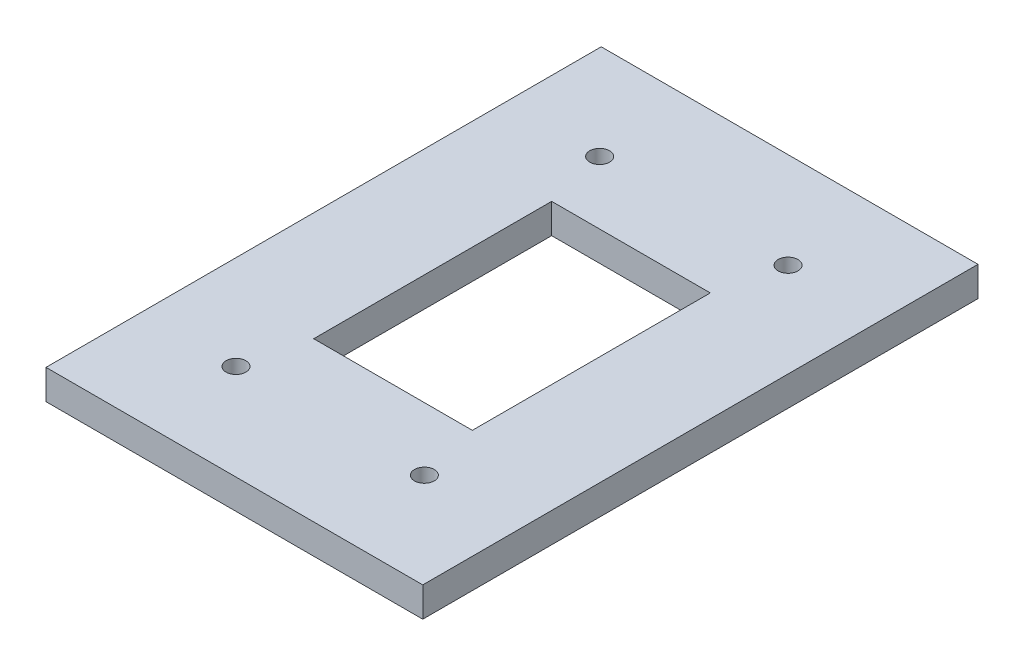
ISO-10303-21;
HEADER;
FILE_DESCRIPTION(('STEP AP214'),'2;1');
FILE_NAME('part.step','',(''),(''),'','','');
FILE_SCHEMA(('AUTOMOTIVE_DESIGN { 1 0 10303 214 1 1 1 1 }'));
ENDSEC;
DATA;
#1=APPLICATION_CONTEXT('core data for automotive mechanical design processes');
#2=APPLICATION_PROTOCOL_DEFINITION('international standard','automotive_design',2000,#1);
#3=PRODUCT_CONTEXT('',#1,'mechanical');
#4=PRODUCT('Part','Part','',(#3));
#5=PRODUCT_RELATED_PRODUCT_CATEGORY('part','',(#4));
#6=PRODUCT_DEFINITION_FORMATION('','',#4);
#7=PRODUCT_DEFINITION_CONTEXT('part definition',#1,'design');
#8=PRODUCT_DEFINITION('design','',#6,#7);
#9=PRODUCT_DEFINITION_SHAPE('','',#8);
#10=(LENGTH_UNIT() NAMED_UNIT(*) SI_UNIT(.MILLI.,.METRE.));
#11=(NAMED_UNIT(*) PLANE_ANGLE_UNIT() SI_UNIT($,.RADIAN.));
#12=(NAMED_UNIT(*) SI_UNIT($,.STERADIAN.) SOLID_ANGLE_UNIT());
#13=UNCERTAINTY_MEASURE_WITH_UNIT(LENGTH_MEASURE(1.E-05),#10,'distance_accuracy_value','');
#14=(GEOMETRIC_REPRESENTATION_CONTEXT(3) GLOBAL_UNCERTAINTY_ASSIGNED_CONTEXT((#13)) GLOBAL_UNIT_ASSIGNED_CONTEXT((#10,
#11,#12)) REPRESENTATION_CONTEXT('',''));
#15=CARTESIAN_POINT('',(0.,0.,0.));
#16=DIRECTION('',(0.,0.,1.));
#17=DIRECTION('',(1.,0.,0.));
#18=AXIS2_PLACEMENT_3D('',#15,#16,#17);
#19=CARTESIAN_POINT('',(-120.65,9.525,-177.8));
#20=DIRECTION('',(1.,0.,0.));
#21=DIRECTION('',(0.,0.,-1.));
#22=AXIS2_PLACEMENT_3D('',#19,#20,#21);
#23=PLANE('',#22);
#24=DIRECTION('',(0.,0.,1.));
#25=VECTOR('',#24,1.);
#26=CARTESIAN_POINT('',(-120.65,-9.525,-177.8));
#27=LINE('',#26,#25);
#28=CARTESIAN_POINT('',(-120.65,-9.525,-177.8));
#29=VERTEX_POINT('',#28);
#30=CARTESIAN_POINT('',(-120.65,-9.525,177.8));
#31=VERTEX_POINT('',#30);
#32=EDGE_CURVE('E157',#29,#31,#27,.T.);
#33=ORIENTED_EDGE('',*,*,#32,.T.);
#34=DIRECTION('',(0.,-1.,0.));
#35=VECTOR('',#34,1.);
#36=CARTESIAN_POINT('',(-120.65,9.525,177.8));
#37=LINE('',#36,#35);
#38=CARTESIAN_POINT('',(-120.65,9.525,177.8));
#39=VERTEX_POINT('',#38);
#40=EDGE_CURVE('E11',#39,#31,#37,.T.);
#41=ORIENTED_EDGE('',*,*,#40,.F.);
#42=DIRECTION('',(0.,0.,1.));
#43=VECTOR('',#42,1.);
#44=CARTESIAN_POINT('',(-120.65,9.525,-177.8));
#45=LINE('',#44,#43);
#46=CARTESIAN_POINT('',(-120.65,9.525,-177.8));
#47=VERTEX_POINT('',#46);
#48=EDGE_CURVE('E160',#47,#39,#45,.T.);
#49=ORIENTED_EDGE('',*,*,#48,.F.);
#50=DIRECTION('',(0.,-1.,0.));
#51=VECTOR('',#50,1.);
#52=CARTESIAN_POINT('',(-120.65,9.525,-177.8));
#53=LINE('',#52,#51);
#54=EDGE_CURVE('E170',#47,#29,#53,.T.);
#55=ORIENTED_EDGE('',*,*,#54,.T.);
#56=EDGE_LOOP('',(#33,#41,#49,#55));
#57=FACE_BOUND('',#56,.T.);
#58=ADVANCED_FACE('F33',(#57),#23,.F.);
#59=CARTESIAN_POINT('',(120.65,9.525,177.8));
#60=DIRECTION('',(0.,0.,-1.));
#61=DIRECTION('',(-1.,0.,0.));
#62=AXIS2_PLACEMENT_3D('',#59,#60,#61);
#63=PLANE('',#62);
#64=DIRECTION('',(1.,0.,0.));
#65=VECTOR('',#64,1.);
#66=CARTESIAN_POINT('',(120.65,-9.525,177.8));
#67=LINE('',#66,#65);
#68=CARTESIAN_POINT('',(120.65,-9.525,177.8));
#69=VERTEX_POINT('',#68);
#70=EDGE_CURVE('E173',#31,#69,#67,.T.);
#71=ORIENTED_EDGE('',*,*,#70,.T.);
#72=DIRECTION('',(0.,-1.,0.));
#73=VECTOR('',#72,1.);
#74=CARTESIAN_POINT('',(120.65,9.525,177.8));
#75=LINE('',#74,#73);
#76=CARTESIAN_POINT('',(120.65,9.525,177.8));
#77=VERTEX_POINT('',#76);
#78=EDGE_CURVE('E40',#77,#69,#75,.T.);
#79=ORIENTED_EDGE('',*,*,#78,.F.);
#80=DIRECTION('',(1.,0.,0.));
#81=VECTOR('',#80,1.);
#82=CARTESIAN_POINT('',(120.65,9.525,177.8));
#83=LINE('',#82,#81);
#84=EDGE_CURVE('E163',#39,#77,#83,.T.);
#85=ORIENTED_EDGE('',*,*,#84,.F.);
#86=ORIENTED_EDGE('',*,*,#40,.T.);
#87=EDGE_LOOP('',(#71,#79,#85,#86));
#88=FACE_BOUND('',#87,.T.);
#89=ADVANCED_FACE('F202',(#88),#63,.F.);
#90=CARTESIAN_POINT('',(120.65,9.525,-177.8));
#91=DIRECTION('',(-1.,0.,0.));
#92=DIRECTION('',(0.,0.,1.));
#93=AXIS2_PLACEMENT_3D('',#90,#91,#92);
#94=PLANE('',#93);
#95=DIRECTION('',(0.,0.,-1.));
#96=VECTOR('',#95,1.);
#97=CARTESIAN_POINT('',(120.65,-9.525,-177.8));
#98=LINE('',#97,#96);
#99=CARTESIAN_POINT('',(120.65,-9.525,-177.8));
#100=VERTEX_POINT('',#99);
#101=EDGE_CURVE('E175',#69,#100,#98,.T.);
#102=ORIENTED_EDGE('',*,*,#101,.T.);
#103=DIRECTION('',(0.,-1.,0.));
#104=VECTOR('',#103,1.);
#105=CARTESIAN_POINT('',(120.65,9.525,-177.8));
#106=LINE('',#105,#104);
#107=CARTESIAN_POINT('',(120.65,9.525,-177.8));
#108=VERTEX_POINT('',#107);
#109=EDGE_CURVE('E180',#108,#100,#106,.T.);
#110=ORIENTED_EDGE('',*,*,#109,.F.);
#111=DIRECTION('',(0.,0.,-1.));
#112=VECTOR('',#111,1.);
#113=CARTESIAN_POINT('',(120.65,9.525,-177.8));
#114=LINE('',#113,#112);
#115=EDGE_CURVE('E166',#77,#108,#114,.T.);
#116=ORIENTED_EDGE('',*,*,#115,.F.);
#117=ORIENTED_EDGE('',*,*,#78,.T.);
#118=EDGE_LOOP('',(#102,#110,#116,#117));
#119=FACE_BOUND('',#118,.T.);
#120=ADVANCED_FACE('F187',(#119),#94,.F.);
#121=CARTESIAN_POINT('',(120.65,9.525,-177.8));
#122=DIRECTION('',(0.,0.,1.));
#123=DIRECTION('',(1.,0.,0.));
#124=AXIS2_PLACEMENT_3D('',#121,#122,#123);
#125=PLANE('',#124);
#126=DIRECTION('',(-1.,0.,0.));
#127=VECTOR('',#126,1.);
#128=CARTESIAN_POINT('',(120.65,-9.525,-177.8));
#129=LINE('',#128,#127);
#130=EDGE_CURVE('E164',#100,#29,#129,.T.);
#131=ORIENTED_EDGE('',*,*,#130,.T.);
#132=ORIENTED_EDGE('',*,*,#54,.F.);
#133=DIRECTION('',(-1.,0.,0.));
#134=VECTOR('',#133,1.);
#135=CARTESIAN_POINT('',(120.65,9.525,-177.8));
#136=LINE('',#135,#134);
#137=EDGE_CURVE('E168',#108,#47,#136,.T.);
#138=ORIENTED_EDGE('',*,*,#137,.F.);
#139=ORIENTED_EDGE('',*,*,#109,.T.);
#140=EDGE_LOOP('',(#131,#132,#138,#139));
#141=FACE_BOUND('',#140,.T.);
#142=ADVANCED_FACE('F195',(#141),#125,.F.);
#143=CARTESIAN_POINT('',(0.,9.525,0.));
#144=DIRECTION('',(0.,-1.,0.));
#145=DIRECTION('',(0.,0.,-1.));
#146=AXIS2_PLACEMENT_3D('',#143,#144,#145);
#147=PLANE('',#146);
#148=DIRECTION('',(1.,0.,0.));
#149=VECTOR('',#148,1.);
#150=CARTESIAN_POINT('',(0.,9.525,-76.2));
#151=LINE('',#150,#149);
#152=CARTESIAN_POINT('',(-50.8,9.52499999999999,-76.2));
#153=VERTEX_POINT('',#152);
#154=CARTESIAN_POINT('',(50.8,9.525,-76.2));
#155=VERTEX_POINT('',#154);
#156=EDGE_CURVE('E122',#153,#155,#151,.T.);
#157=ORIENTED_EDGE('',*,*,#156,.T.);
#158=DIRECTION('',(0.,0.,1.));
#159=VECTOR('',#158,1.);
#160=CARTESIAN_POINT('',(50.8,9.525,0.));
#161=LINE('',#160,#159);
#162=CARTESIAN_POINT('',(50.8,9.52499999999999,76.2));
#163=VERTEX_POINT('',#162);
#164=EDGE_CURVE('E103',#155,#163,#161,.T.);
#165=ORIENTED_EDGE('',*,*,#164,.T.);
#166=DIRECTION('',(-1.,0.,0.));
#167=VECTOR('',#166,1.);
#168=CARTESIAN_POINT('',(0.,9.525,76.2));
#169=LINE('',#168,#167);
#170=CARTESIAN_POINT('',(-50.8,9.52499999999999,76.2));
#171=VERTEX_POINT('',#170);
#172=EDGE_CURVE('E131',#163,#171,#169,.T.);
#173=ORIENTED_EDGE('',*,*,#172,.T.);
#174=DIRECTION('',(0.,0.,-1.));
#175=VECTOR('',#174,1.);
#176=CARTESIAN_POINT('',(-50.8,9.525,0.));
#177=LINE('',#176,#175);
#178=EDGE_CURVE('E128',#171,#153,#177,.T.);
#179=ORIENTED_EDGE('',*,*,#178,.T.);
#180=EDGE_LOOP('',(#157,#165,#173,#179));
#181=FACE_BOUND('',#180,.T.);
#182=CARTESIAN_POINT('',(-60.325,9.525,116.459));
#183=DIRECTION('',(0.,1.,0.));
#184=DIRECTION('',(0.,0.,-1.));
#185=AXIS2_PLACEMENT_3D('',#182,#183,#184);
#186=CIRCLE('',#185,6.34999999999999);
#187=CARTESIAN_POINT('',(-60.325,9.525,110.109));
#188=VERTEX_POINT('',#187);
#189=EDGE_CURVE('E135',#188,#188,#186,.T.);
#190=ORIENTED_EDGE('',*,*,#189,.F.);
#191=EDGE_LOOP('',(#190));
#192=FACE_BOUND('',#191,.T.);
#193=CARTESIAN_POINT('',(60.3249999999999,9.525,116.459));
#194=DIRECTION('',(0.,1.,0.));
#195=DIRECTION('',(0.,0.,1.));
#196=AXIS2_PLACEMENT_3D('',#193,#194,#195);
#197=CIRCLE('',#196,6.34999999999999);
#198=CARTESIAN_POINT('',(60.3249999999999,9.525,122.809));
#199=VERTEX_POINT('',#198);
#200=EDGE_CURVE('E146',#199,#199,#197,.T.);
#201=ORIENTED_EDGE('',*,*,#200,.F.);
#202=EDGE_LOOP('',(#201));
#203=FACE_BOUND('',#202,.T.);
#204=CARTESIAN_POINT('',(60.3249999999999,9.525,-116.459));
#205=DIRECTION('',(0.,1.,0.));
#206=DIRECTION('',(0.,0.,-1.));
#207=AXIS2_PLACEMENT_3D('',#204,#205,#206);
#208=CIRCLE('',#207,6.34999999999999);
#209=CARTESIAN_POINT('',(60.3249999999999,9.525,-122.809));
#210=VERTEX_POINT('',#209);
#211=EDGE_CURVE('E140',#210,#210,#208,.T.);
#212=ORIENTED_EDGE('',*,*,#211,.F.);
#213=EDGE_LOOP('',(#212));
#214=FACE_BOUND('',#213,.T.);
#215=CARTESIAN_POINT('',(-60.325,9.525,-116.459));
#216=DIRECTION('',(0.,1.,0.));
#217=DIRECTION('',(0.,0.,1.));
#218=AXIS2_PLACEMENT_3D('',#215,#216,#217);
#219=CIRCLE('',#218,6.34999999999999);
#220=CARTESIAN_POINT('',(-60.325,9.525,-110.109));
#221=VERTEX_POINT('',#220);
#222=EDGE_CURVE('E139',#221,#221,#219,.T.);
#223=ORIENTED_EDGE('',*,*,#222,.F.);
#224=EDGE_LOOP('',(#223));
#225=FACE_BOUND('',#224,.T.);
#226=ORIENTED_EDGE('',*,*,#48,.T.);
#227=ORIENTED_EDGE('',*,*,#84,.T.);
#228=ORIENTED_EDGE('',*,*,#115,.T.);
#229=ORIENTED_EDGE('',*,*,#137,.T.);
#230=EDGE_LOOP('',(#226,#227,#228,#229));
#231=FACE_BOUND('',#230,.T.);
#232=ADVANCED_FACE('F201',(#181,#192,#203,#214,#225,#231),#147,.F.);
#233=CARTESIAN_POINT('',(0.,-9.525,0.));
#234=DIRECTION('',(0.,-1.,0.));
#235=DIRECTION('',(0.,0.,-1.));
#236=AXIS2_PLACEMENT_3D('',#233,#234,#235);
#237=PLANE('',#236);
#238=DIRECTION('',(0.,0.,-1.));
#239=VECTOR('',#238,1.);
#240=CARTESIAN_POINT('',(50.8,-9.525,76.2));
#241=LINE('',#240,#239);
#242=CARTESIAN_POINT('',(50.8,-9.525,76.2));
#243=VERTEX_POINT('',#242);
#244=CARTESIAN_POINT('',(50.8,-9.525,-76.2));
#245=VERTEX_POINT('',#244);
#246=EDGE_CURVE('E100',#243,#245,#241,.T.);
#247=ORIENTED_EDGE('',*,*,#246,.T.);
#248=DIRECTION('',(-1.,0.,0.));
#249=VECTOR('',#248,1.);
#250=CARTESIAN_POINT('',(-50.8,-9.525,-76.2));
#251=LINE('',#250,#249);
#252=CARTESIAN_POINT('',(-50.8,-9.525,-76.2));
#253=VERTEX_POINT('',#252);
#254=EDGE_CURVE('E109',#245,#253,#251,.T.);
#255=ORIENTED_EDGE('',*,*,#254,.T.);
#256=DIRECTION('',(0.,0.,1.));
#257=VECTOR('',#256,1.);
#258=CARTESIAN_POINT('',(-50.8,-9.525,76.2));
#259=LINE('',#258,#257);
#260=CARTESIAN_POINT('',(-50.8,-9.525,76.2));
#261=VERTEX_POINT('',#260);
#262=EDGE_CURVE('E55',#253,#261,#259,.T.);
#263=ORIENTED_EDGE('',*,*,#262,.T.);
#264=DIRECTION('',(1.,0.,0.));
#265=VECTOR('',#264,1.);
#266=CARTESIAN_POINT('',(-50.8,-9.525,76.2));
#267=LINE('',#266,#265);
#268=EDGE_CURVE('E106',#261,#243,#267,.T.);
#269=ORIENTED_EDGE('',*,*,#268,.T.);
#270=EDGE_LOOP('',(#247,#255,#263,#269));
#271=FACE_BOUND('',#270,.T.);
#272=CARTESIAN_POINT('',(-60.325,-9.525,116.459));
#273=DIRECTION('',(0.,1.,0.));
#274=DIRECTION('',(0.,0.,-1.));
#275=AXIS2_PLACEMENT_3D('',#272,#273,#274);
#276=CIRCLE('',#275,6.34999999999999);
#277=CARTESIAN_POINT('',(-60.325,-9.525,110.109));
#278=VERTEX_POINT('',#277);
#279=EDGE_CURVE('E149',#278,#278,#276,.T.);
#280=ORIENTED_EDGE('',*,*,#279,.T.);
#281=EDGE_LOOP('',(#280));
#282=FACE_BOUND('',#281,.T.);
#283=CARTESIAN_POINT('',(60.3249999999999,-9.525,116.459));
#284=DIRECTION('',(0.,1.,0.));
#285=DIRECTION('',(0.,0.,1.));
#286=AXIS2_PLACEMENT_3D('',#283,#284,#285);
#287=CIRCLE('',#286,6.34999999999999);
#288=CARTESIAN_POINT('',(60.3249999999999,-9.525,122.809));
#289=VERTEX_POINT('',#288);
#290=EDGE_CURVE('E143',#289,#289,#287,.T.);
#291=ORIENTED_EDGE('',*,*,#290,.T.);
#292=EDGE_LOOP('',(#291));
#293=FACE_BOUND('',#292,.T.);
#294=CARTESIAN_POINT('',(60.3249999999999,-9.525,-116.459));
#295=DIRECTION('',(0.,1.,0.));
#296=DIRECTION('',(0.,0.,-1.));
#297=AXIS2_PLACEMENT_3D('',#294,#295,#296);
#298=CIRCLE('',#297,6.34999999999999);
#299=CARTESIAN_POINT('',(60.3249999999999,-9.525,-122.809));
#300=VERTEX_POINT('',#299);
#301=EDGE_CURVE('E136',#300,#300,#298,.T.);
#302=ORIENTED_EDGE('',*,*,#301,.T.);
#303=EDGE_LOOP('',(#302));
#304=FACE_BOUND('',#303,.T.);
#305=CARTESIAN_POINT('',(-60.325,-9.525,-116.459));
#306=DIRECTION('',(0.,1.,0.));
#307=DIRECTION('',(0.,0.,1.));
#308=AXIS2_PLACEMENT_3D('',#305,#306,#307);
#309=CIRCLE('',#308,6.34999999999999);
#310=CARTESIAN_POINT('',(-60.325,-9.525,-110.109));
#311=VERTEX_POINT('',#310);
#312=EDGE_CURVE('E154',#311,#311,#309,.T.);
#313=ORIENTED_EDGE('',*,*,#312,.T.);
#314=EDGE_LOOP('',(#313));
#315=FACE_BOUND('',#314,.T.);
#316=ORIENTED_EDGE('',*,*,#32,.F.);
#317=ORIENTED_EDGE('',*,*,#130,.F.);
#318=ORIENTED_EDGE('',*,*,#101,.F.);
#319=ORIENTED_EDGE('',*,*,#70,.F.);
#320=EDGE_LOOP('',(#316,#317,#318,#319));
#321=FACE_BOUND('',#320,.T.);
#322=ADVANCED_FACE('F113',(#271,#282,#293,#304,#315,#321),#237,.T.);
#323=CARTESIAN_POINT('',(-60.325,-9.525,-116.459));
#324=DIRECTION('',(0.,1.,0.));
#325=DIRECTION('',(0.,0.,1.));
#326=AXIS2_PLACEMENT_3D('',#323,#324,#325);
#327=CYLINDRICAL_SURFACE('',#326,6.34999999999999);
#328=ORIENTED_EDGE('',*,*,#312,.F.);
#329=EDGE_LOOP('',(#328));
#330=FACE_BOUND('',#329,.T.);
#331=ORIENTED_EDGE('',*,*,#222,.T.);
#332=EDGE_LOOP('',(#331));
#333=FACE_BOUND('',#332,.T.);
#334=ADVANCED_FACE('F214',(#330,#333),#327,.F.);
#335=CARTESIAN_POINT('',(60.3249999999999,-9.525,-116.459));
#336=DIRECTION('',(0.,1.,0.));
#337=DIRECTION('',(0.,0.,1.));
#338=AXIS2_PLACEMENT_3D('',#335,#336,#337);
#339=CYLINDRICAL_SURFACE('',#338,6.34999999999999);
#340=ORIENTED_EDGE('',*,*,#301,.F.);
#341=EDGE_LOOP('',(#340));
#342=FACE_BOUND('',#341,.T.);
#343=ORIENTED_EDGE('',*,*,#211,.T.);
#344=EDGE_LOOP('',(#343));
#345=FACE_BOUND('',#344,.T.);
#346=ADVANCED_FACE('F220',(#342,#345),#339,.F.);
#347=CARTESIAN_POINT('',(60.3249999999999,-9.525,116.459));
#348=DIRECTION('',(0.,1.,0.));
#349=DIRECTION('',(0.,0.,1.));
#350=AXIS2_PLACEMENT_3D('',#347,#348,#349);
#351=CYLINDRICAL_SURFACE('',#350,6.34999999999999);
#352=ORIENTED_EDGE('',*,*,#290,.F.);
#353=EDGE_LOOP('',(#352));
#354=FACE_BOUND('',#353,.T.);
#355=ORIENTED_EDGE('',*,*,#200,.T.);
#356=EDGE_LOOP('',(#355));
#357=FACE_BOUND('',#356,.T.);
#358=ADVANCED_FACE('F225',(#354,#357),#351,.F.);
#359=CARTESIAN_POINT('',(-60.325,-9.525,116.459));
#360=DIRECTION('',(0.,1.,0.));
#361=DIRECTION('',(0.,0.,1.));
#362=AXIS2_PLACEMENT_3D('',#359,#360,#361);
#363=CYLINDRICAL_SURFACE('',#362,6.34999999999999);
#364=ORIENTED_EDGE('',*,*,#279,.F.);
#365=EDGE_LOOP('',(#364));
#366=FACE_BOUND('',#365,.T.);
#367=ORIENTED_EDGE('',*,*,#189,.T.);
#368=EDGE_LOOP('',(#367));
#369=FACE_BOUND('',#368,.T.);
#370=ADVANCED_FACE('F222',(#366,#369),#363,.F.);
#371=CARTESIAN_POINT('',(50.8,-9.525,76.2));
#372=DIRECTION('',(1.,0.,0.));
#373=DIRECTION('',(0.,0.,-1.));
#374=AXIS2_PLACEMENT_3D('',#371,#372,#373);
#375=PLANE('',#374);
#376=DIRECTION('',(0.,1.,0.));
#377=VECTOR('',#376,1.);
#378=CARTESIAN_POINT('',(50.8,-9.525,-76.2));
#379=LINE('',#378,#377);
#380=EDGE_CURVE('E47',#245,#155,#379,.T.);
#381=ORIENTED_EDGE('',*,*,#380,.F.);
#382=ORIENTED_EDGE('',*,*,#246,.F.);
#383=DIRECTION('',(0.,1.,0.));
#384=VECTOR('',#383,1.);
#385=CARTESIAN_POINT('',(50.8,-9.525,76.2));
#386=LINE('',#385,#384);
#387=EDGE_CURVE('E120',#243,#163,#386,.T.);
#388=ORIENTED_EDGE('',*,*,#387,.T.);
#389=ORIENTED_EDGE('',*,*,#164,.F.);
#390=EDGE_LOOP('',(#381,#382,#388,#389));
#391=FACE_BOUND('',#390,.T.);
#392=ADVANCED_FACE('F97',(#391),#375,.F.);
#393=CARTESIAN_POINT('',(-50.8,-9.525,76.2));
#394=DIRECTION('',(0.,0.,1.));
#395=DIRECTION('',(1.,0.,0.));
#396=AXIS2_PLACEMENT_3D('',#393,#394,#395);
#397=PLANE('',#396);
#398=ORIENTED_EDGE('',*,*,#387,.F.);
#399=ORIENTED_EDGE('',*,*,#268,.F.);
#400=DIRECTION('',(0.,1.,0.));
#401=VECTOR('',#400,1.);
#402=CARTESIAN_POINT('',(-50.8,-9.525,76.2));
#403=LINE('',#402,#401);
#404=EDGE_CURVE('E123',#261,#171,#403,.T.);
#405=ORIENTED_EDGE('',*,*,#404,.T.);
#406=ORIENTED_EDGE('',*,*,#172,.F.);
#407=EDGE_LOOP('',(#398,#399,#405,#406));
#408=FACE_BOUND('',#407,.T.);
#409=ADVANCED_FACE('F235',(#408),#397,.F.);
#410=CARTESIAN_POINT('',(-50.8,-9.525,76.2));
#411=DIRECTION('',(-1.,0.,0.));
#412=DIRECTION('',(0.,0.,1.));
#413=AXIS2_PLACEMENT_3D('',#410,#411,#412);
#414=PLANE('',#413);
#415=ORIENTED_EDGE('',*,*,#404,.F.);
#416=ORIENTED_EDGE('',*,*,#262,.F.);
#417=DIRECTION('',(0.,1.,0.));
#418=VECTOR('',#417,1.);
#419=CARTESIAN_POINT('',(-50.8,-9.525,-76.2));
#420=LINE('',#419,#418);
#421=EDGE_CURVE('E105',#253,#153,#420,.T.);
#422=ORIENTED_EDGE('',*,*,#421,.T.);
#423=ORIENTED_EDGE('',*,*,#178,.F.);
#424=EDGE_LOOP('',(#415,#416,#422,#423));
#425=FACE_BOUND('',#424,.T.);
#426=ADVANCED_FACE('F238',(#425),#414,.F.);
#427=CARTESIAN_POINT('',(-50.8,-9.525,-76.2));
#428=DIRECTION('',(0.,0.,-1.));
#429=DIRECTION('',(-1.,0.,0.));
#430=AXIS2_PLACEMENT_3D('',#427,#428,#429);
#431=PLANE('',#430);
#432=ORIENTED_EDGE('',*,*,#421,.F.);
#433=ORIENTED_EDGE('',*,*,#254,.F.);
#434=ORIENTED_EDGE('',*,*,#380,.T.);
#435=ORIENTED_EDGE('',*,*,#156,.F.);
#436=EDGE_LOOP('',(#432,#433,#434,#435));
#437=FACE_BOUND('',#436,.T.);
#438=ADVANCED_FACE('F110',(#437),#431,.F.);
#439=CLOSED_SHELL('',(#58,#89,#120,#142,#232,#322,#334,#346,#358,#370,#392,#409,#426,#438));
#440=MANIFOLD_SOLID_BREP('B2',#439);
#441=ADVANCED_BREP_SHAPE_REPRESENTATION('',(#18,#440),#14);
#442=SHAPE_DEFINITION_REPRESENTATION(#9,#441);
ENDSEC;
END-ISO-10303-21;
